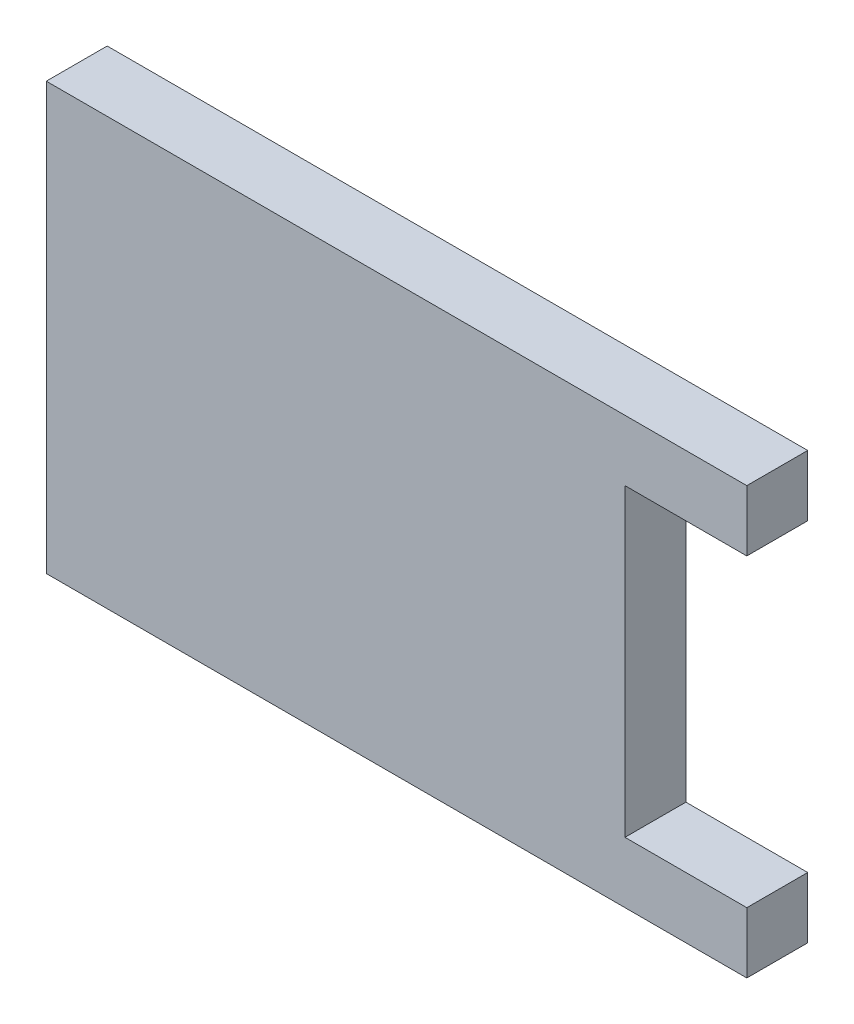
ISO-10303-21;
HEADER;
FILE_DESCRIPTION(('STEP AP214'),'2;1');
FILE_NAME('part.step','',(''),(''),'','','');
FILE_SCHEMA(('AUTOMOTIVE_DESIGN { 1 0 10303 214 1 1 1 1 }'));
ENDSEC;
DATA;
#1=APPLICATION_CONTEXT('core data for automotive mechanical design processes');
#2=APPLICATION_PROTOCOL_DEFINITION('international standard','automotive_design',2000,#1);
#3=PRODUCT_CONTEXT('',#1,'mechanical');
#4=PRODUCT('Part','Part','',(#3));
#5=PRODUCT_RELATED_PRODUCT_CATEGORY('part','',(#4));
#6=PRODUCT_DEFINITION_FORMATION('','',#4);
#7=PRODUCT_DEFINITION_CONTEXT('part definition',#1,'design');
#8=PRODUCT_DEFINITION('design','',#6,#7);
#9=PRODUCT_DEFINITION_SHAPE('','',#8);
#10=(LENGTH_UNIT() NAMED_UNIT(*) SI_UNIT(.MILLI.,.METRE.));
#11=(NAMED_UNIT(*) PLANE_ANGLE_UNIT() SI_UNIT($,.RADIAN.));
#12=(NAMED_UNIT(*) SI_UNIT($,.STERADIAN.) SOLID_ANGLE_UNIT());
#13=UNCERTAINTY_MEASURE_WITH_UNIT(LENGTH_MEASURE(1.E-05),#10,'distance_accuracy_value','');
#14=(GEOMETRIC_REPRESENTATION_CONTEXT(3) GLOBAL_UNCERTAINTY_ASSIGNED_CONTEXT((#13)) GLOBAL_UNIT_ASSIGNED_CONTEXT((#10,
#11,#12)) REPRESENTATION_CONTEXT('',''));
#15=CARTESIAN_POINT('',(0.,0.,0.));
#16=DIRECTION('',(0.,0.,1.));
#17=DIRECTION('',(1.,0.,0.));
#18=AXIS2_PLACEMENT_3D('',#15,#16,#17);
#19=CARTESIAN_POINT('',(11.5,7.,2.));
#20=DIRECTION('',(-1.,0.,0.));
#21=DIRECTION('',(0.,0.,1.));
#22=AXIS2_PLACEMENT_3D('',#19,#20,#21);
#23=PLANE('',#22);
#24=DIRECTION('',(0.,1.,0.));
#25=VECTOR('',#24,1.);
#26=CARTESIAN_POINT('',(11.5,7.,0.));
#27=LINE('',#26,#25);
#28=CARTESIAN_POINT('',(11.5,-7.,0.));
#29=VERTEX_POINT('',#28);
#30=CARTESIAN_POINT('',(11.5,-5.,0.));
#31=VERTEX_POINT('',#30);
#32=EDGE_CURVE('E124',#29,#31,#27,.T.);
#33=ORIENTED_EDGE('',*,*,#32,.T.);
#34=DIRECTION('',(0.,0.,1.));
#35=VECTOR('',#34,1.);
#36=CARTESIAN_POINT('',(11.5,-5.,0.));
#37=LINE('',#36,#35);
#38=CARTESIAN_POINT('',(11.5,-5.,2.));
#39=VERTEX_POINT('',#38);
#40=EDGE_CURVE('E156',#31,#39,#37,.T.);
#41=ORIENTED_EDGE('',*,*,#40,.T.);
#42=DIRECTION('',(0.,1.,0.));
#43=VECTOR('',#42,1.);
#44=CARTESIAN_POINT('',(11.5,7.,2.));
#45=LINE('',#44,#43);
#46=CARTESIAN_POINT('',(11.5,-7.,2.));
#47=VERTEX_POINT('',#46);
#48=EDGE_CURVE('E143',#47,#39,#45,.T.);
#49=ORIENTED_EDGE('',*,*,#48,.F.);
#50=DIRECTION('',(0.,0.,-1.));
#51=VECTOR('',#50,1.);
#52=CARTESIAN_POINT('',(11.5,-7.,2.));
#53=LINE('',#52,#51);
#54=EDGE_CURVE('E38',#47,#29,#53,.T.);
#55=ORIENTED_EDGE('',*,*,#54,.T.);
#56=EDGE_LOOP('',(#33,#41,#49,#55));
#57=FACE_BOUND('',#56,.T.);
#58=ADVANCED_FACE('F30',(#57),#23,.F.);
#59=CARTESIAN_POINT('',(-11.5,7.,2.));
#60=DIRECTION('',(1.,0.,0.));
#61=DIRECTION('',(0.,0.,-1.));
#62=AXIS2_PLACEMENT_3D('',#59,#60,#61);
#63=PLANE('',#62);
#64=DIRECTION('',(0.,-1.,0.));
#65=VECTOR('',#64,1.);
#66=CARTESIAN_POINT('',(-11.5,7.,0.));
#67=LINE('',#66,#65);
#68=CARTESIAN_POINT('',(-11.5,7.,0.));
#69=VERTEX_POINT('',#68);
#70=CARTESIAN_POINT('',(-11.5,-7.,0.));
#71=VERTEX_POINT('',#70);
#72=EDGE_CURVE('E128',#69,#71,#67,.T.);
#73=ORIENTED_EDGE('',*,*,#72,.T.);
#74=DIRECTION('',(0.,0.,-1.));
#75=VECTOR('',#74,1.);
#76=CARTESIAN_POINT('',(-11.5,-7.,2.));
#77=LINE('',#76,#75);
#78=CARTESIAN_POINT('',(-11.5,-7.,2.));
#79=VERTEX_POINT('',#78);
#80=EDGE_CURVE('E11',#79,#71,#77,.T.);
#81=ORIENTED_EDGE('',*,*,#80,.F.);
#82=DIRECTION('',(0.,-1.,0.));
#83=VECTOR('',#82,1.);
#84=CARTESIAN_POINT('',(-11.5,7.,2.));
#85=LINE('',#84,#83);
#86=CARTESIAN_POINT('',(-11.5,7.,2.));
#87=VERTEX_POINT('',#86);
#88=EDGE_CURVE('E133',#87,#79,#85,.T.);
#89=ORIENTED_EDGE('',*,*,#88,.F.);
#90=DIRECTION('',(0.,0.,-1.));
#91=VECTOR('',#90,1.);
#92=CARTESIAN_POINT('',(-11.5,7.,2.));
#93=LINE('',#92,#91);
#94=EDGE_CURVE('E134',#87,#69,#93,.T.);
#95=ORIENTED_EDGE('',*,*,#94,.T.);
#96=EDGE_LOOP('',(#73,#81,#89,#95));
#97=FACE_BOUND('',#96,.T.);
#98=ADVANCED_FACE('F32',(#97),#63,.F.);
#99=CARTESIAN_POINT('',(-11.5,-7.,2.));
#100=DIRECTION('',(0.,1.,0.));
#101=DIRECTION('',(0.,0.,1.));
#102=AXIS2_PLACEMENT_3D('',#99,#100,#101);
#103=PLANE('',#102);
#104=DIRECTION('',(1.,0.,0.));
#105=VECTOR('',#104,1.);
#106=CARTESIAN_POINT('',(-11.5,-7.,0.));
#107=LINE('',#106,#105);
#108=EDGE_CURVE('E125',#71,#29,#107,.T.);
#109=ORIENTED_EDGE('',*,*,#108,.T.);
#110=ORIENTED_EDGE('',*,*,#54,.F.);
#111=DIRECTION('',(1.,0.,0.));
#112=VECTOR('',#111,1.);
#113=CARTESIAN_POINT('',(-11.5,-7.,2.));
#114=LINE('',#113,#112);
#115=EDGE_CURVE('E82',#79,#47,#114,.T.);
#116=ORIENTED_EDGE('',*,*,#115,.F.);
#117=ORIENTED_EDGE('',*,*,#80,.T.);
#118=EDGE_LOOP('',(#109,#110,#116,#117));
#119=FACE_BOUND('',#118,.T.);
#120=ADVANCED_FACE('F177',(#119),#103,.F.);
#121=CARTESIAN_POINT('',(11.5,5.,2.));
#122=VERTEX_POINT('',#121);
#123=CARTESIAN_POINT('',(11.5,7.,2.));
#124=VERTEX_POINT('',#123);
#125=EDGE_CURVE('E119',#122,#124,#45,.T.);
#126=ORIENTED_EDGE('',*,*,#125,.F.);
#127=DIRECTION('',(0.,0.,1.));
#128=VECTOR('',#127,1.);
#129=CARTESIAN_POINT('',(11.5,5.,0.));
#130=LINE('',#129,#128);
#131=CARTESIAN_POINT('',(11.5,5.,0.));
#132=VERTEX_POINT('',#131);
#133=EDGE_CURVE('E107',#132,#122,#130,.T.);
#134=ORIENTED_EDGE('',*,*,#133,.F.);
#135=CARTESIAN_POINT('',(11.5,7.,0.));
#136=VERTEX_POINT('',#135);
#137=EDGE_CURVE('E118',#132,#136,#27,.T.);
#138=ORIENTED_EDGE('',*,*,#137,.T.);
#139=DIRECTION('',(0.,0.,-1.));
#140=VECTOR('',#139,1.);
#141=CARTESIAN_POINT('',(11.5,7.,2.));
#142=LINE('',#141,#140);
#143=EDGE_CURVE('E136',#124,#136,#142,.T.);
#144=ORIENTED_EDGE('',*,*,#143,.F.);
#145=EDGE_LOOP('',(#126,#134,#138,#144));
#146=FACE_BOUND('',#145,.T.);
#147=ADVANCED_FACE('F116',(#146),#23,.F.);
#148=CARTESIAN_POINT('',(-11.5,7.,2.));
#149=DIRECTION('',(0.,-1.,0.));
#150=DIRECTION('',(0.,0.,-1.));
#151=AXIS2_PLACEMENT_3D('',#148,#149,#150);
#152=PLANE('',#151);
#153=DIRECTION('',(-1.,0.,0.));
#154=VECTOR('',#153,1.);
#155=CARTESIAN_POINT('',(-11.5,7.,0.));
#156=LINE('',#155,#154);
#157=EDGE_CURVE('E75',#136,#69,#156,.T.);
#158=ORIENTED_EDGE('',*,*,#157,.T.);
#159=ORIENTED_EDGE('',*,*,#94,.F.);
#160=DIRECTION('',(-1.,0.,0.));
#161=VECTOR('',#160,1.);
#162=CARTESIAN_POINT('',(-11.5,7.,2.));
#163=LINE('',#162,#161);
#164=EDGE_CURVE('E54',#124,#87,#163,.T.);
#165=ORIENTED_EDGE('',*,*,#164,.F.);
#166=ORIENTED_EDGE('',*,*,#143,.T.);
#167=EDGE_LOOP('',(#158,#159,#165,#166));
#168=FACE_BOUND('',#167,.T.);
#169=ADVANCED_FACE('F168',(#168),#152,.F.);
#170=CARTESIAN_POINT('',(-11.5,-7.,2.));
#171=DIRECTION('',(0.,0.,1.));
#172=DIRECTION('',(1.,0.,0.));
#173=AXIS2_PLACEMENT_3D('',#170,#171,#172);
#174=PLANE('',#173);
#175=DIRECTION('',(1.,0.,0.));
#176=VECTOR('',#175,1.);
#177=CARTESIAN_POINT('',(11.5,-5.,2.));
#178=LINE('',#177,#176);
#179=CARTESIAN_POINT('',(7.5,-5.,2.));
#180=VERTEX_POINT('',#179);
#181=EDGE_CURVE('E112',#180,#39,#178,.T.);
#182=ORIENTED_EDGE('',*,*,#181,.F.);
#183=DIRECTION('',(0.,-1.,0.));
#184=VECTOR('',#183,1.);
#185=CARTESIAN_POINT('',(7.49999999999999,5.,2.));
#186=LINE('',#185,#184);
#187=CARTESIAN_POINT('',(7.49999999999999,5.,2.));
#188=VERTEX_POINT('',#187);
#189=EDGE_CURVE('E152',#188,#180,#186,.T.);
#190=ORIENTED_EDGE('',*,*,#189,.F.);
#191=DIRECTION('',(-1.,0.,0.));
#192=VECTOR('',#191,1.);
#193=CARTESIAN_POINT('',(11.5,5.,2.));
#194=LINE('',#193,#192);
#195=EDGE_CURVE('E150',#122,#188,#194,.T.);
#196=ORIENTED_EDGE('',*,*,#195,.F.);
#197=ORIENTED_EDGE('',*,*,#125,.T.);
#198=ORIENTED_EDGE('',*,*,#164,.T.);
#199=ORIENTED_EDGE('',*,*,#88,.T.);
#200=ORIENTED_EDGE('',*,*,#115,.T.);
#201=ORIENTED_EDGE('',*,*,#48,.T.);
#202=EDGE_LOOP('',(#182,#190,#196,#197,#198,#199,#200,#201));
#203=FACE_BOUND('',#202,.T.);
#204=ADVANCED_FACE('F170',(#203),#174,.T.);
#205=CARTESIAN_POINT('',(-11.5,-7.,0.));
#206=DIRECTION('',(0.,0.,1.));
#207=DIRECTION('',(1.,0.,0.));
#208=AXIS2_PLACEMENT_3D('',#205,#206,#207);
#209=PLANE('',#208);
#210=DIRECTION('',(0.,-1.,0.));
#211=VECTOR('',#210,1.);
#212=CARTESIAN_POINT('',(7.49999999999999,5.,0.));
#213=LINE('',#212,#211);
#214=CARTESIAN_POINT('',(7.49999999999999,5.,0.));
#215=VERTEX_POINT('',#214);
#216=CARTESIAN_POINT('',(7.5,-5.,0.));
#217=VERTEX_POINT('',#216);
#218=EDGE_CURVE('E45',#215,#217,#213,.T.);
#219=ORIENTED_EDGE('',*,*,#218,.T.);
#220=DIRECTION('',(1.,0.,0.));
#221=VECTOR('',#220,1.);
#222=CARTESIAN_POINT('',(11.5,-5.,0.));
#223=LINE('',#222,#221);
#224=EDGE_CURVE('E120',#217,#31,#223,.T.);
#225=ORIENTED_EDGE('',*,*,#224,.T.);
#226=ORIENTED_EDGE('',*,*,#32,.F.);
#227=ORIENTED_EDGE('',*,*,#108,.F.);
#228=ORIENTED_EDGE('',*,*,#72,.F.);
#229=ORIENTED_EDGE('',*,*,#157,.F.);
#230=ORIENTED_EDGE('',*,*,#137,.F.);
#231=DIRECTION('',(-1.,0.,0.));
#232=VECTOR('',#231,1.);
#233=CARTESIAN_POINT('',(11.5,5.,0.));
#234=LINE('',#233,#232);
#235=EDGE_CURVE('E103',#132,#215,#234,.T.);
#236=ORIENTED_EDGE('',*,*,#235,.T.);
#237=EDGE_LOOP('',(#219,#225,#226,#227,#228,#229,#230,#236));
#238=FACE_BOUND('',#237,.T.);
#239=ADVANCED_FACE('F122',(#238),#209,.F.);
#240=CARTESIAN_POINT('',(11.5,-5.,0.));
#241=DIRECTION('',(0.,-1.,0.));
#242=DIRECTION('',(1.,0.,0.));
#243=AXIS2_PLACEMENT_3D('',#240,#241,#242);
#244=PLANE('',#243);
#245=ORIENTED_EDGE('',*,*,#181,.T.);
#246=ORIENTED_EDGE('',*,*,#40,.F.);
#247=ORIENTED_EDGE('',*,*,#224,.F.);
#248=DIRECTION('',(0.,0.,1.));
#249=VECTOR('',#248,1.);
#250=CARTESIAN_POINT('',(7.5,-5.,0.));
#251=LINE('',#250,#249);
#252=EDGE_CURVE('E158',#217,#180,#251,.T.);
#253=ORIENTED_EDGE('',*,*,#252,.T.);
#254=EDGE_LOOP('',(#245,#246,#247,#253));
#255=FACE_BOUND('',#254,.T.);
#256=ADVANCED_FACE('F211',(#255),#244,.F.);
#257=CARTESIAN_POINT('',(7.49999999999999,5.,0.));
#258=DIRECTION('',(-1.,0.,0.));
#259=DIRECTION('',(0.,-1.,0.));
#260=AXIS2_PLACEMENT_3D('',#257,#258,#259);
#261=PLANE('',#260);
#262=ORIENTED_EDGE('',*,*,#189,.T.);
#263=ORIENTED_EDGE('',*,*,#252,.F.);
#264=ORIENTED_EDGE('',*,*,#218,.F.);
#265=DIRECTION('',(0.,0.,1.));
#266=VECTOR('',#265,1.);
#267=CARTESIAN_POINT('',(7.49999999999999,5.,0.));
#268=LINE('',#267,#266);
#269=EDGE_CURVE('E109',#215,#188,#268,.T.);
#270=ORIENTED_EDGE('',*,*,#269,.T.);
#271=EDGE_LOOP('',(#262,#263,#264,#270));
#272=FACE_BOUND('',#271,.T.);
#273=ADVANCED_FACE('F219',(#272),#261,.F.);
#274=CARTESIAN_POINT('',(11.5,5.,0.));
#275=DIRECTION('',(0.,1.,0.));
#276=DIRECTION('',(-1.,0.,0.));
#277=AXIS2_PLACEMENT_3D('',#274,#275,#276);
#278=PLANE('',#277);
#279=ORIENTED_EDGE('',*,*,#195,.T.);
#280=ORIENTED_EDGE('',*,*,#269,.F.);
#281=ORIENTED_EDGE('',*,*,#235,.F.);
#282=ORIENTED_EDGE('',*,*,#133,.T.);
#283=EDGE_LOOP('',(#279,#280,#281,#282));
#284=FACE_BOUND('',#283,.T.);
#285=ADVANCED_FACE('F106',(#284),#278,.F.);
#286=CLOSED_SHELL('',(#58,#98,#120,#147,#169,#204,#239,#256,#273,#285));
#287=MANIFOLD_SOLID_BREP('B2',#286);
#288=ADVANCED_BREP_SHAPE_REPRESENTATION('',(#18,#287),#14);
#289=SHAPE_DEFINITION_REPRESENTATION(#9,#288);
ENDSEC;
END-ISO-10303-21;
